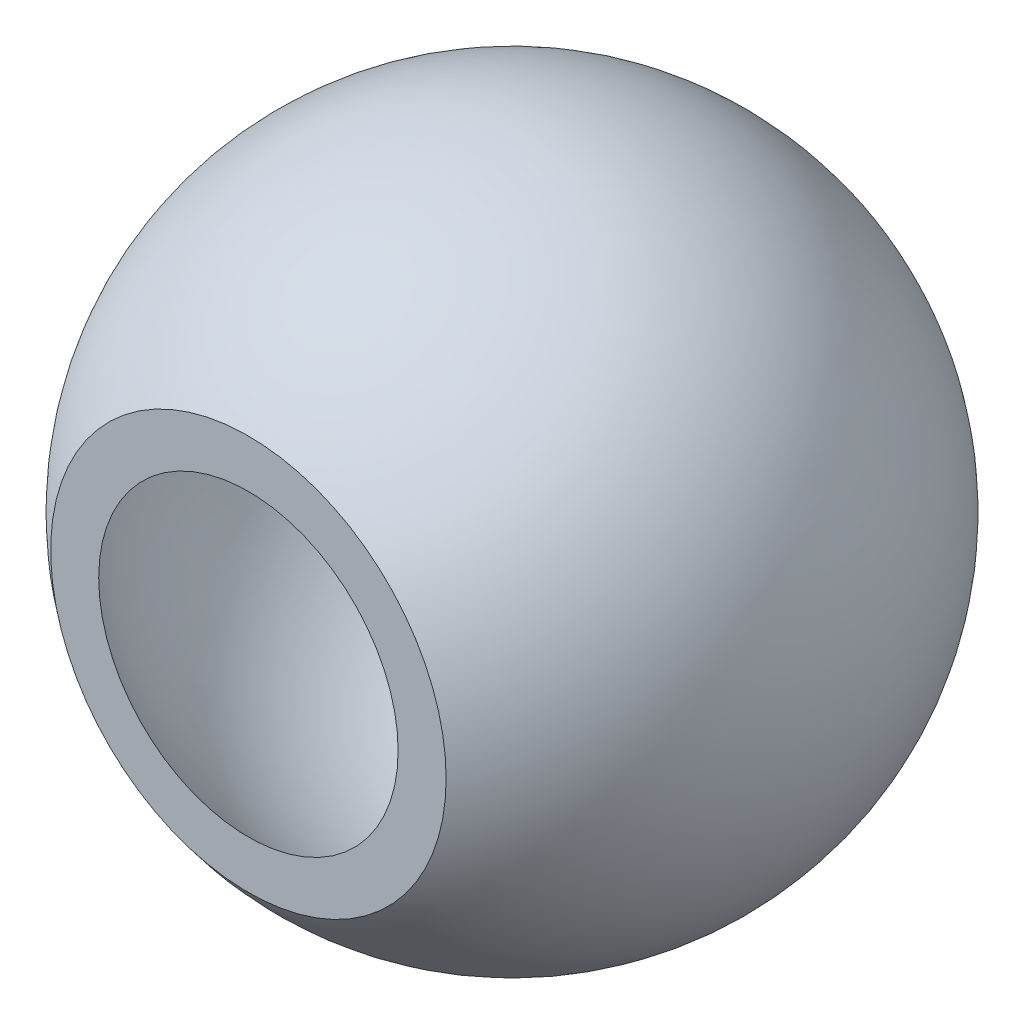
ISO-10303-21;
HEADER;
FILE_DESCRIPTION(('STEP AP214'),'2;1');
FILE_NAME('part.step','',(''),(''),'','','');
FILE_SCHEMA(('AUTOMOTIVE_DESIGN { 1 0 10303 214 1 1 1 1 }'));
ENDSEC;
DATA;
#1=APPLICATION_CONTEXT('core data for automotive mechanical design processes');
#2=APPLICATION_PROTOCOL_DEFINITION('international standard','automotive_design',2000,#1);
#3=PRODUCT_CONTEXT('',#1,'mechanical');
#4=PRODUCT('Part','Part','',(#3));
#5=PRODUCT_RELATED_PRODUCT_CATEGORY('part','',(#4));
#6=PRODUCT_DEFINITION_FORMATION('','',#4);
#7=PRODUCT_DEFINITION_CONTEXT('part definition',#1,'design');
#8=PRODUCT_DEFINITION('design','',#6,#7);
#9=PRODUCT_DEFINITION_SHAPE('','',#8);
#10=(LENGTH_UNIT() NAMED_UNIT(*) SI_UNIT(.MILLI.,.METRE.));
#11=(NAMED_UNIT(*) PLANE_ANGLE_UNIT() SI_UNIT($,.RADIAN.));
#12=(NAMED_UNIT(*) SI_UNIT($,.STERADIAN.) SOLID_ANGLE_UNIT());
#13=UNCERTAINTY_MEASURE_WITH_UNIT(LENGTH_MEASURE(1.E-05),#10,'distance_accuracy_value','');
#14=(GEOMETRIC_REPRESENTATION_CONTEXT(3) GLOBAL_UNCERTAINTY_ASSIGNED_CONTEXT((#13)) GLOBAL_UNIT_ASSIGNED_CONTEXT((#10,
#11,#12)) REPRESENTATION_CONTEXT('',''));
#15=CARTESIAN_POINT('',(0.,0.,0.));
#16=DIRECTION('',(0.,0.,1.));
#17=DIRECTION('',(1.,0.,0.));
#18=AXIS2_PLACEMENT_3D('',#15,#16,#17);
#19=CARTESIAN_POINT('',(0.,0.,0.));
#20=DIRECTION('',(-1.,0.,0.));
#21=DIRECTION('',(0.,-1.,0.));
#22=AXIS2_PLACEMENT_3D('',#19,#20,#21);
#23=SPHERICAL_SURFACE('',#22,25.);
#24=CARTESIAN_POINT('',(0.,0.,0.));
#25=DIRECTION('',(0.,0.,1.));
#26=DIRECTION('',(1.,0.,0.));
#27=AXIS2_PLACEMENT_3D('',#24,#25,#26);
#28=SPHERICAL_SURFACE('',#27,25.);
#29=CARTESIAN_POINT('',(0.,0.,20.));
#30=DIRECTION('',(0.,0.,1.));
#31=DIRECTION('',(1.,0.,0.));
#32=AXIS2_PLACEMENT_3D('',#29,#30,#31);
#33=CIRCLE('',#32,15.);
#34=CARTESIAN_POINT('',(15.,0.,20.));
#35=VERTEX_POINT('',#34);
#36=EDGE_CURVE('E10',#35,#35,#33,.T.);
#37=ORIENTED_EDGE('',*,*,#36,.F.);
#38=EDGE_LOOP('',(#37));
#39=FACE_BOUND('',#38,.T.);
#40=ADVANCED_FACE('F15',(#39),#28,.T.);
#41=CARTESIAN_POINT('',(0.,-23.,20.));
#42=DIRECTION('',(0.,0.,1.));
#43=DIRECTION('',(1.,0.,0.));
#44=AXIS2_PLACEMENT_3D('',#41,#42,#43);
#45=PLANE('',#44);
#46=CARTESIAN_POINT('',(0.,0.,20.));
#47=DIRECTION('',(0.,0.,1.));
#48=DIRECTION('',(1.,0.,0.));
#49=AXIS2_PLACEMENT_3D('',#46,#47,#48);
#50=CIRCLE('',#49,11.3578166916005);
#51=CARTESIAN_POINT('',(11.3578166916005,0.,20.));
#52=VERTEX_POINT('',#51);
#53=EDGE_CURVE('E21',#52,#52,#50,.T.);
#54=ORIENTED_EDGE('',*,*,#53,.F.);
#55=EDGE_LOOP('',(#54));
#56=FACE_BOUND('',#55,.T.);
#57=ORIENTED_EDGE('',*,*,#36,.T.);
#58=EDGE_LOOP('',(#57));
#59=FACE_BOUND('',#58,.T.);
#60=ADVANCED_FACE('F29',(#56,#59),#45,.T.);
#61=CARTESIAN_POINT('',(0.,0.,0.));
#62=DIRECTION('',(-1.,0.,0.));
#63=DIRECTION('',(0.,-1.,0.));
#64=AXIS2_PLACEMENT_3D('',#61,#62,#63);
#65=SPHERICAL_SURFACE('',#64,23.);
#66=CARTESIAN_POINT('',(0.,0.,0.));
#67=DIRECTION('',(0.,0.,1.));
#68=DIRECTION('',(1.,0.,0.));
#69=AXIS2_PLACEMENT_3D('',#66,#67,#68);
#70=SPHERICAL_SURFACE('',#69,23.);
#71=ORIENTED_EDGE('',*,*,#53,.T.);
#72=EDGE_LOOP('',(#71));
#73=FACE_BOUND('',#72,.T.);
#74=ADVANCED_FACE('F27',(#73),#70,.F.);
#75=CLOSED_SHELL('',(#40,#60,#74));
#76=MANIFOLD_SOLID_BREP('B1',#75);
#77=ADVANCED_BREP_SHAPE_REPRESENTATION('',(#18,#76),#14);
#78=SHAPE_DEFINITION_REPRESENTATION(#9,#77);
ENDSEC;
END-ISO-10303-21;
